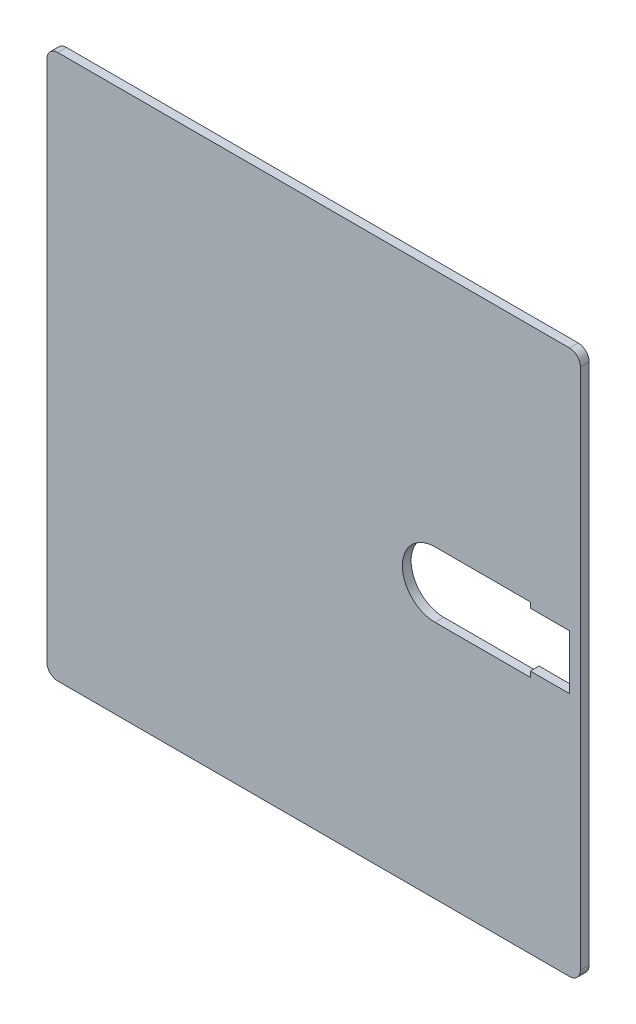
ISO-10303-21;
HEADER;
FILE_DESCRIPTION(('STEP AP214'),'2;1');
FILE_NAME('part.step','',(''),(''),'','','');
FILE_SCHEMA(('AUTOMOTIVE_DESIGN { 1 0 10303 214 1 1 1 1 }'));
ENDSEC;
DATA;
#1=APPLICATION_CONTEXT('core data for automotive mechanical design processes');
#2=APPLICATION_PROTOCOL_DEFINITION('international standard','automotive_design',2000,#1);
#3=PRODUCT_CONTEXT('',#1,'mechanical');
#4=PRODUCT('Part','Part','',(#3));
#5=PRODUCT_RELATED_PRODUCT_CATEGORY('part','',(#4));
#6=PRODUCT_DEFINITION_FORMATION('','',#4);
#7=PRODUCT_DEFINITION_CONTEXT('part definition',#1,'design');
#8=PRODUCT_DEFINITION('design','',#6,#7);
#9=PRODUCT_DEFINITION_SHAPE('','',#8);
#10=(LENGTH_UNIT() NAMED_UNIT(*) SI_UNIT(.MILLI.,.METRE.));
#11=(NAMED_UNIT(*) PLANE_ANGLE_UNIT() SI_UNIT($,.RADIAN.));
#12=(NAMED_UNIT(*) SI_UNIT($,.STERADIAN.) SOLID_ANGLE_UNIT());
#13=UNCERTAINTY_MEASURE_WITH_UNIT(LENGTH_MEASURE(1.E-05),#10,'distance_accuracy_value','');
#14=(GEOMETRIC_REPRESENTATION_CONTEXT(3) GLOBAL_UNCERTAINTY_ASSIGNED_CONTEXT((#13)) GLOBAL_UNIT_ASSIGNED_CONTEXT((#10,
#11,#12)) REPRESENTATION_CONTEXT('',''));
#15=CARTESIAN_POINT('',(0.,0.,0.));
#16=DIRECTION('',(0.,0.,1.));
#17=DIRECTION('',(1.,0.,0.));
#18=AXIS2_PLACEMENT_3D('',#15,#16,#17);
#19=CARTESIAN_POINT('',(0.,0.,1.6));
#20=DIRECTION('',(0.,1.,0.));
#21=DIRECTION('',(0.,0.,1.));
#22=AXIS2_PLACEMENT_3D('',#19,#20,#21);
#23=PLANE('',#22);
#24=DIRECTION('',(1.,0.,0.));
#25=VECTOR('',#24,1.);
#26=CARTESIAN_POINT('',(0.,0.,0.));
#27=LINE('',#26,#25);
#28=CARTESIAN_POINT('',(2.,0.,0.));
#29=VERTEX_POINT('',#28);
#30=CARTESIAN_POINT('',(96.,0.,0.));
#31=VERTEX_POINT('',#30);
#32=EDGE_CURVE('E218',#29,#31,#27,.T.);
#33=ORIENTED_EDGE('',*,*,#32,.T.);
#34=DIRECTION('',(0.,0.,-1.));
#35=VECTOR('',#34,1.);
#36=CARTESIAN_POINT('',(96.,0.,1.6));
#37=LINE('',#36,#35);
#38=CARTESIAN_POINT('',(96.,0.,1.6));
#39=VERTEX_POINT('',#38);
#40=EDGE_CURVE('E258',#31,#39,#37,.F.);
#41=ORIENTED_EDGE('',*,*,#40,.T.);
#42=DIRECTION('',(1.,0.,0.));
#43=VECTOR('',#42,1.);
#44=CARTESIAN_POINT('',(0.,0.,1.6));
#45=LINE('',#44,#43);
#46=CARTESIAN_POINT('',(2.,0.,1.6));
#47=VERTEX_POINT('',#46);
#48=EDGE_CURVE('E187',#47,#39,#45,.T.);
#49=ORIENTED_EDGE('',*,*,#48,.F.);
#50=DIRECTION('',(0.,0.,-1.));
#51=VECTOR('',#50,1.);
#52=CARTESIAN_POINT('',(2.,0.,0.));
#53=LINE('',#52,#51);
#54=EDGE_CURVE('E255',#47,#29,#53,.T.);
#55=ORIENTED_EDGE('',*,*,#54,.T.);
#56=EDGE_LOOP('',(#33,#41,#49,#55));
#57=FACE_BOUND('',#56,.T.);
#58=ADVANCED_FACE('F33',(#57),#23,.F.);
#59=CARTESIAN_POINT('',(98.,0.,1.6));
#60=DIRECTION('',(-1.,0.,0.));
#61=DIRECTION('',(0.,0.,1.));
#62=AXIS2_PLACEMENT_3D('',#59,#60,#61);
#63=PLANE('',#62);
#64=DIRECTION('',(0.,1.,0.));
#65=VECTOR('',#64,1.);
#66=CARTESIAN_POINT('',(98.,0.,1.6));
#67=LINE('',#66,#65);
#68=CARTESIAN_POINT('',(98.,2.,1.6));
#69=VERTEX_POINT('',#68);
#70=CARTESIAN_POINT('',(98.,98.,1.6));
#71=VERTEX_POINT('',#70);
#72=EDGE_CURVE('E190',#69,#71,#67,.T.);
#73=ORIENTED_EDGE('',*,*,#72,.F.);
#74=DIRECTION('',(0.,0.,-1.));
#75=VECTOR('',#74,1.);
#76=CARTESIAN_POINT('',(98.,2.,1.6));
#77=LINE('',#76,#75);
#78=CARTESIAN_POINT('',(98.,2.,0.));
#79=VERTEX_POINT('',#78);
#80=EDGE_CURVE('E244',#69,#79,#77,.T.);
#81=ORIENTED_EDGE('',*,*,#80,.T.);
#82=DIRECTION('',(0.,1.,0.));
#83=VECTOR('',#82,1.);
#84=CARTESIAN_POINT('',(98.,0.,0.));
#85=LINE('',#84,#83);
#86=CARTESIAN_POINT('',(98.,98.,0.));
#87=VERTEX_POINT('',#86);
#88=EDGE_CURVE('E221',#79,#87,#85,.T.);
#89=ORIENTED_EDGE('',*,*,#88,.T.);
#90=DIRECTION('',(0.,0.,-1.));
#91=VECTOR('',#90,1.);
#92=CARTESIAN_POINT('',(98.,98.,1.6));
#93=LINE('',#92,#91);
#94=EDGE_CURVE('E157',#87,#71,#93,.F.);
#95=ORIENTED_EDGE('',*,*,#94,.T.);
#96=EDGE_LOOP('',(#73,#81,#89,#95));
#97=FACE_BOUND('',#96,.T.);
#98=ADVANCED_FACE('F299',(#97),#63,.F.);
#99=CARTESIAN_POINT('',(0.,100.,1.6));
#100=DIRECTION('',(0.,1.,0.));
#101=DIRECTION('',(0.,0.,1.));
#102=AXIS2_PLACEMENT_3D('',#99,#100,#101);
#103=PLANE('',#102);
#104=DIRECTION('',(1.,0.,0.));
#105=VECTOR('',#104,1.);
#106=CARTESIAN_POINT('',(0.,100.,0.));
#107=LINE('',#106,#105);
#108=CARTESIAN_POINT('',(2.,100.,0.));
#109=VERTEX_POINT('',#108);
#110=CARTESIAN_POINT('',(96.,100.,0.));
#111=VERTEX_POINT('',#110);
#112=EDGE_CURVE('E224',#109,#111,#107,.T.);
#113=ORIENTED_EDGE('',*,*,#112,.F.);
#114=DIRECTION('',(0.,0.,-1.));
#115=VECTOR('',#114,1.);
#116=CARTESIAN_POINT('',(2.,100.,1.6));
#117=LINE('',#116,#115);
#118=CARTESIAN_POINT('',(2.,100.,1.6));
#119=VERTEX_POINT('',#118);
#120=EDGE_CURVE('E11',#109,#119,#117,.F.);
#121=ORIENTED_EDGE('',*,*,#120,.T.);
#122=DIRECTION('',(1.,0.,0.));
#123=VECTOR('',#122,1.);
#124=CARTESIAN_POINT('',(0.,100.,1.6));
#125=LINE('',#124,#123);
#126=CARTESIAN_POINT('',(96.,100.,1.6));
#127=VERTEX_POINT('',#126);
#128=EDGE_CURVE('E193',#119,#127,#125,.T.);
#129=ORIENTED_EDGE('',*,*,#128,.T.);
#130=DIRECTION('',(0.,0.,-1.));
#131=VECTOR('',#130,1.);
#132=CARTESIAN_POINT('',(96.,100.,0.));
#133=LINE('',#132,#131);
#134=EDGE_CURVE('E41',#127,#111,#133,.T.);
#135=ORIENTED_EDGE('',*,*,#134,.T.);
#136=EDGE_LOOP('',(#113,#121,#129,#135));
#137=FACE_BOUND('',#136,.T.);
#138=ADVANCED_FACE('F274',(#137),#103,.T.);
#139=CARTESIAN_POINT('',(71.3,50.,1.6));
#140=DIRECTION('',(0.,0.,-1.));
#141=DIRECTION('',(-1.,0.,0.));
#142=AXIS2_PLACEMENT_3D('',#139,#140,#141);
#143=CYLINDRICAL_SURFACE('',#142,6.);
#144=CARTESIAN_POINT('',(71.3,50.,0.));
#145=DIRECTION('',(0.,0.,1.));
#146=DIRECTION('',(1.,0.,0.));
#147=AXIS2_PLACEMENT_3D('',#144,#145,#146);
#148=CIRCLE('',#147,6.);
#149=CARTESIAN_POINT('',(71.3,56.,0.));
#150=VERTEX_POINT('',#149);
#151=CARTESIAN_POINT('',(71.3,44.,0.));
#152=VERTEX_POINT('',#151);
#153=EDGE_CURVE('E152',#150,#152,#148,.T.);
#154=ORIENTED_EDGE('',*,*,#153,.F.);
#155=DIRECTION('',(0.,0.,-1.));
#156=VECTOR('',#155,1.);
#157=CARTESIAN_POINT('',(71.3,56.,1.6));
#158=LINE('',#157,#156);
#159=CARTESIAN_POINT('',(71.3,56.,1.6));
#160=VERTEX_POINT('',#159);
#161=EDGE_CURVE('E147',#160,#150,#158,.T.);
#162=ORIENTED_EDGE('',*,*,#161,.F.);
#163=CARTESIAN_POINT('',(71.3,50.,1.6));
#164=DIRECTION('',(0.,0.,1.));
#165=DIRECTION('',(1.,0.,0.));
#166=AXIS2_PLACEMENT_3D('',#163,#164,#165);
#167=CIRCLE('',#166,6.);
#168=CARTESIAN_POINT('',(71.3,44.,1.6));
#169=VERTEX_POINT('',#168);
#170=EDGE_CURVE('E150',#160,#169,#167,.T.);
#171=ORIENTED_EDGE('',*,*,#170,.T.);
#172=DIRECTION('',(0.,0.,-1.));
#173=VECTOR('',#172,1.);
#174=CARTESIAN_POINT('',(71.3,44.,1.6));
#175=LINE('',#174,#173);
#176=EDGE_CURVE('E198',#169,#152,#175,.T.);
#177=ORIENTED_EDGE('',*,*,#176,.T.);
#178=EDGE_LOOP('',(#154,#162,#171,#177));
#179=FACE_BOUND('',#178,.T.);
#180=ADVANCED_FACE('F149',(#179),#143,.F.);
#181=CARTESIAN_POINT('',(0.,56.,1.6));
#182=DIRECTION('',(0.,-1.,0.));
#183=DIRECTION('',(0.,0.,-1.));
#184=AXIS2_PLACEMENT_3D('',#181,#182,#183);
#185=PLANE('',#184);
#186=DIRECTION('',(-1.,0.,0.));
#187=VECTOR('',#186,1.);
#188=CARTESIAN_POINT('',(0.,56.,0.));
#189=LINE('',#188,#187);
#190=CARTESIAN_POINT('',(88.8,56.,0.));
#191=VERTEX_POINT('',#190);
#192=EDGE_CURVE('E200',#191,#150,#189,.T.);
#193=ORIENTED_EDGE('',*,*,#192,.F.);
#194=DIRECTION('',(0.,0.,-1.));
#195=VECTOR('',#194,1.);
#196=CARTESIAN_POINT('',(88.8,56.,1.6));
#197=LINE('',#196,#195);
#198=CARTESIAN_POINT('',(88.8,56.,1.6));
#199=VERTEX_POINT('',#198);
#200=EDGE_CURVE('E158',#199,#191,#197,.T.);
#201=ORIENTED_EDGE('',*,*,#200,.F.);
#202=DIRECTION('',(-1.,0.,0.));
#203=VECTOR('',#202,1.);
#204=CARTESIAN_POINT('',(0.,56.,1.6));
#205=LINE('',#204,#203);
#206=EDGE_CURVE('E164',#199,#160,#205,.T.);
#207=ORIENTED_EDGE('',*,*,#206,.T.);
#208=ORIENTED_EDGE('',*,*,#161,.T.);
#209=EDGE_LOOP('',(#193,#201,#207,#208));
#210=FACE_BOUND('',#209,.T.);
#211=ADVANCED_FACE('F171',(#210),#185,.T.);
#212=CARTESIAN_POINT('',(88.8,0.,1.6));
#213=DIRECTION('',(-1.,0.,0.));
#214=DIRECTION('',(0.,0.,1.));
#215=AXIS2_PLACEMENT_3D('',#212,#213,#214);
#216=PLANE('',#215);
#217=DIRECTION('',(0.,1.,0.));
#218=VECTOR('',#217,1.);
#219=CARTESIAN_POINT('',(88.8,0.,0.));
#220=LINE('',#219,#218);
#221=CARTESIAN_POINT('',(88.8,55.,0.));
#222=VERTEX_POINT('',#221);
#223=EDGE_CURVE('E202',#222,#191,#220,.T.);
#224=ORIENTED_EDGE('',*,*,#223,.F.);
#225=DIRECTION('',(0.,0.,-1.));
#226=VECTOR('',#225,1.);
#227=CARTESIAN_POINT('',(88.8,55.,1.6));
#228=LINE('',#227,#226);
#229=CARTESIAN_POINT('',(88.8,55.,1.6));
#230=VERTEX_POINT('',#229);
#231=EDGE_CURVE('E240',#230,#222,#228,.T.);
#232=ORIENTED_EDGE('',*,*,#231,.F.);
#233=DIRECTION('',(0.,1.,0.));
#234=VECTOR('',#233,1.);
#235=CARTESIAN_POINT('',(88.8,0.,1.6));
#236=LINE('',#235,#234);
#237=EDGE_CURVE('E172',#230,#199,#236,.T.);
#238=ORIENTED_EDGE('',*,*,#237,.T.);
#239=ORIENTED_EDGE('',*,*,#200,.T.);
#240=EDGE_LOOP('',(#224,#232,#238,#239));
#241=FACE_BOUND('',#240,.T.);
#242=ADVANCED_FACE('F332',(#241),#216,.T.);
#243=CARTESIAN_POINT('',(0.,55.,1.6));
#244=DIRECTION('',(0.,-1.,0.));
#245=DIRECTION('',(0.,0.,-1.));
#246=AXIS2_PLACEMENT_3D('',#243,#244,#245);
#247=PLANE('',#246);
#248=DIRECTION('',(-1.,0.,0.));
#249=VECTOR('',#248,1.);
#250=CARTESIAN_POINT('',(0.,55.,0.));
#251=LINE('',#250,#249);
#252=CARTESIAN_POINT('',(96.,55.,0.));
#253=VERTEX_POINT('',#252);
#254=EDGE_CURVE('E205',#253,#222,#251,.T.);
#255=ORIENTED_EDGE('',*,*,#254,.F.);
#256=DIRECTION('',(0.,0.,-1.));
#257=VECTOR('',#256,1.);
#258=CARTESIAN_POINT('',(96.,55.,1.6));
#259=LINE('',#258,#257);
#260=CARTESIAN_POINT('',(96.,55.,1.6));
#261=VERTEX_POINT('',#260);
#262=EDGE_CURVE('E238',#261,#253,#259,.T.);
#263=ORIENTED_EDGE('',*,*,#262,.F.);
#264=DIRECTION('',(-1.,0.,0.));
#265=VECTOR('',#264,1.);
#266=CARTESIAN_POINT('',(0.,55.,1.6));
#267=LINE('',#266,#265);
#268=EDGE_CURVE('E174',#261,#230,#267,.T.);
#269=ORIENTED_EDGE('',*,*,#268,.T.);
#270=ORIENTED_EDGE('',*,*,#231,.T.);
#271=EDGE_LOOP('',(#255,#263,#269,#270));
#272=FACE_BOUND('',#271,.T.);
#273=ADVANCED_FACE('F328',(#272),#247,.T.);
#274=CARTESIAN_POINT('',(96.,0.,1.6));
#275=DIRECTION('',(-1.,0.,0.));
#276=DIRECTION('',(0.,0.,1.));
#277=AXIS2_PLACEMENT_3D('',#274,#275,#276);
#278=PLANE('',#277);
#279=DIRECTION('',(0.,1.,0.));
#280=VECTOR('',#279,1.);
#281=CARTESIAN_POINT('',(96.,0.,0.));
#282=LINE('',#281,#280);
#283=CARTESIAN_POINT('',(96.,45.,0.));
#284=VERTEX_POINT('',#283);
#285=EDGE_CURVE('E208',#284,#253,#282,.T.);
#286=ORIENTED_EDGE('',*,*,#285,.F.);
#287=DIRECTION('',(0.,0.,-1.));
#288=VECTOR('',#287,1.);
#289=CARTESIAN_POINT('',(96.,45.,1.6));
#290=LINE('',#289,#288);
#291=CARTESIAN_POINT('',(96.,45.,1.6));
#292=VERTEX_POINT('',#291);
#293=EDGE_CURVE('E236',#292,#284,#290,.T.);
#294=ORIENTED_EDGE('',*,*,#293,.F.);
#295=DIRECTION('',(0.,1.,0.));
#296=VECTOR('',#295,1.);
#297=CARTESIAN_POINT('',(96.,0.,1.6));
#298=LINE('',#297,#296);
#299=EDGE_CURVE('E179',#292,#261,#298,.T.);
#300=ORIENTED_EDGE('',*,*,#299,.T.);
#301=ORIENTED_EDGE('',*,*,#262,.T.);
#302=EDGE_LOOP('',(#286,#294,#300,#301));
#303=FACE_BOUND('',#302,.T.);
#304=ADVANCED_FACE('F324',(#303),#278,.T.);
#305=CARTESIAN_POINT('',(0.,45.,1.6));
#306=DIRECTION('',(0.,-1.,0.));
#307=DIRECTION('',(0.,0.,-1.));
#308=AXIS2_PLACEMENT_3D('',#305,#306,#307);
#309=PLANE('',#308);
#310=DIRECTION('',(-1.,0.,0.));
#311=VECTOR('',#310,1.);
#312=CARTESIAN_POINT('',(0.,45.,0.));
#313=LINE('',#312,#311);
#314=CARTESIAN_POINT('',(88.8,45.,0.));
#315=VERTEX_POINT('',#314);
#316=EDGE_CURVE('E211',#284,#315,#313,.T.);
#317=ORIENTED_EDGE('',*,*,#316,.T.);
#318=DIRECTION('',(0.,0.,-1.));
#319=VECTOR('',#318,1.);
#320=CARTESIAN_POINT('',(88.8,45.,1.6));
#321=LINE('',#320,#319);
#322=CARTESIAN_POINT('',(88.8,45.,1.6));
#323=VERTEX_POINT('',#322);
#324=EDGE_CURVE('E233',#323,#315,#321,.T.);
#325=ORIENTED_EDGE('',*,*,#324,.F.);
#326=DIRECTION('',(-1.,0.,0.));
#327=VECTOR('',#326,1.);
#328=CARTESIAN_POINT('',(0.,45.,1.6));
#329=LINE('',#328,#327);
#330=EDGE_CURVE('E182',#292,#323,#329,.T.);
#331=ORIENTED_EDGE('',*,*,#330,.F.);
#332=ORIENTED_EDGE('',*,*,#293,.T.);
#333=EDGE_LOOP('',(#317,#325,#331,#332));
#334=FACE_BOUND('',#333,.T.);
#335=ADVANCED_FACE('F320',(#334),#309,.F.);
#336=CARTESIAN_POINT('',(88.8,0.,1.6));
#337=DIRECTION('',(1.,0.,0.));
#338=DIRECTION('',(0.,0.,-1.));
#339=AXIS2_PLACEMENT_3D('',#336,#337,#338);
#340=PLANE('',#339);
#341=DIRECTION('',(0.,-1.,0.));
#342=VECTOR('',#341,1.);
#343=CARTESIAN_POINT('',(88.8,0.,0.));
#344=LINE('',#343,#342);
#345=CARTESIAN_POINT('',(88.8,44.,0.));
#346=VERTEX_POINT('',#345);
#347=EDGE_CURVE('E213',#315,#346,#344,.T.);
#348=ORIENTED_EDGE('',*,*,#347,.T.);
#349=DIRECTION('',(0.,0.,-1.));
#350=VECTOR('',#349,1.);
#351=CARTESIAN_POINT('',(88.8,44.,1.6));
#352=LINE('',#351,#350);
#353=CARTESIAN_POINT('',(88.8,44.,1.6));
#354=VERTEX_POINT('',#353);
#355=EDGE_CURVE('E230',#354,#346,#352,.T.);
#356=ORIENTED_EDGE('',*,*,#355,.F.);
#357=DIRECTION('',(0.,-1.,0.));
#358=VECTOR('',#357,1.);
#359=CARTESIAN_POINT('',(88.8,0.,1.6));
#360=LINE('',#359,#358);
#361=EDGE_CURVE('E184',#323,#354,#360,.T.);
#362=ORIENTED_EDGE('',*,*,#361,.F.);
#363=ORIENTED_EDGE('',*,*,#324,.T.);
#364=EDGE_LOOP('',(#348,#356,#362,#363));
#365=FACE_BOUND('',#364,.T.);
#366=ADVANCED_FACE('F316',(#365),#340,.F.);
#367=CARTESIAN_POINT('',(0.,44.,1.6));
#368=DIRECTION('',(0.,-1.,0.));
#369=DIRECTION('',(1.,0.,0.));
#370=AXIS2_PLACEMENT_3D('',#367,#368,#369);
#371=PLANE('',#370);
#372=DIRECTION('',(-1.,0.,0.));
#373=VECTOR('',#372,1.);
#374=CARTESIAN_POINT('',(0.,44.,0.));
#375=LINE('',#374,#373);
#376=EDGE_CURVE('E215',#346,#152,#375,.T.);
#377=ORIENTED_EDGE('',*,*,#376,.T.);
#378=ORIENTED_EDGE('',*,*,#176,.F.);
#379=DIRECTION('',(-1.,0.,0.));
#380=VECTOR('',#379,1.);
#381=CARTESIAN_POINT('',(0.,44.,1.6));
#382=LINE('',#381,#380);
#383=EDGE_CURVE('E167',#354,#169,#382,.T.);
#384=ORIENTED_EDGE('',*,*,#383,.F.);
#385=ORIENTED_EDGE('',*,*,#355,.T.);
#386=EDGE_LOOP('',(#377,#378,#384,#385));
#387=FACE_BOUND('',#386,.T.);
#388=ADVANCED_FACE('F313',(#387),#371,.F.);
#389=CARTESIAN_POINT('',(0.,0.,1.6));
#390=DIRECTION('',(-1.,0.,0.));
#391=DIRECTION('',(0.,0.,1.));
#392=AXIS2_PLACEMENT_3D('',#389,#390,#391);
#393=PLANE('',#392);
#394=DIRECTION('',(0.,1.,0.));
#395=VECTOR('',#394,1.);
#396=CARTESIAN_POINT('',(0.,0.,0.));
#397=LINE('',#396,#395);
#398=CARTESIAN_POINT('',(0.,2.,0.));
#399=VERTEX_POINT('',#398);
#400=CARTESIAN_POINT('',(0.,98.,0.));
#401=VERTEX_POINT('',#400);
#402=EDGE_CURVE('E169',#399,#401,#397,.T.);
#403=ORIENTED_EDGE('',*,*,#402,.F.);
#404=DIRECTION('',(0.,0.,-1.));
#405=VECTOR('',#404,1.);
#406=CARTESIAN_POINT('',(0.,2.,1.6));
#407=LINE('',#406,#405);
#408=CARTESIAN_POINT('',(0.,2.,1.6));
#409=VERTEX_POINT('',#408);
#410=EDGE_CURVE('E55',#399,#409,#407,.F.);
#411=ORIENTED_EDGE('',*,*,#410,.T.);
#412=DIRECTION('',(0.,1.,0.));
#413=VECTOR('',#412,1.);
#414=CARTESIAN_POINT('',(0.,0.,1.6));
#415=LINE('',#414,#413);
#416=CARTESIAN_POINT('',(0.,98.,1.6));
#417=VERTEX_POINT('',#416);
#418=EDGE_CURVE('E196',#409,#417,#415,.T.);
#419=ORIENTED_EDGE('',*,*,#418,.T.);
#420=DIRECTION('',(0.,0.,-1.));
#421=VECTOR('',#420,1.);
#422=CARTESIAN_POINT('',(0.,98.,1.6));
#423=LINE('',#422,#421);
#424=EDGE_CURVE('E267',#417,#401,#423,.T.);
#425=ORIENTED_EDGE('',*,*,#424,.T.);
#426=EDGE_LOOP('',(#403,#411,#419,#425));
#427=FACE_BOUND('',#426,.T.);
#428=ADVANCED_FACE('F284',(#427),#393,.T.);
#429=CARTESIAN_POINT('',(0.,0.,1.6));
#430=DIRECTION('',(0.,0.,1.));
#431=DIRECTION('',(1.,0.,0.));
#432=AXIS2_PLACEMENT_3D('',#429,#430,#431);
#433=PLANE('',#432);
#434=ORIENTED_EDGE('',*,*,#170,.F.);
#435=ORIENTED_EDGE('',*,*,#206,.F.);
#436=ORIENTED_EDGE('',*,*,#237,.F.);
#437=ORIENTED_EDGE('',*,*,#268,.F.);
#438=ORIENTED_EDGE('',*,*,#299,.F.);
#439=ORIENTED_EDGE('',*,*,#330,.T.);
#440=ORIENTED_EDGE('',*,*,#361,.T.);
#441=ORIENTED_EDGE('',*,*,#383,.T.);
#442=EDGE_LOOP('',(#434,#435,#436,#437,#438,#439,#440,#441));
#443=FACE_BOUND('',#442,.T.);
#444=ORIENTED_EDGE('',*,*,#48,.T.);
#445=CARTESIAN_POINT('',(96.,2.,1.6));
#446=DIRECTION('',(0.,0.,1.));
#447=DIRECTION('',(1.,0.,0.));
#448=AXIS2_PLACEMENT_3D('',#445,#446,#447);
#449=CIRCLE('',#448,2.);
#450=EDGE_CURVE('E265',#39,#69,#449,.T.);
#451=ORIENTED_EDGE('',*,*,#450,.T.);
#452=ORIENTED_EDGE('',*,*,#72,.T.);
#453=CARTESIAN_POINT('',(96.,98.,1.6));
#454=DIRECTION('',(0.,0.,1.));
#455=DIRECTION('',(1.,0.,0.));
#456=AXIS2_PLACEMENT_3D('',#453,#454,#455);
#457=CIRCLE('',#456,2.);
#458=EDGE_CURVE('E260',#71,#127,#457,.T.);
#459=ORIENTED_EDGE('',*,*,#458,.T.);
#460=ORIENTED_EDGE('',*,*,#128,.F.);
#461=CARTESIAN_POINT('',(2.,98.,1.6));
#462=DIRECTION('',(0.,0.,1.));
#463=DIRECTION('',(1.,0.,0.));
#464=AXIS2_PLACEMENT_3D('',#461,#462,#463);
#465=CIRCLE('',#464,2.);
#466=EDGE_CURVE('E48',#119,#417,#465,.T.);
#467=ORIENTED_EDGE('',*,*,#466,.T.);
#468=ORIENTED_EDGE('',*,*,#418,.F.);
#469=CARTESIAN_POINT('',(2.,2.,1.6));
#470=DIRECTION('',(0.,0.,1.));
#471=DIRECTION('',(1.,0.,0.));
#472=AXIS2_PLACEMENT_3D('',#469,#470,#471);
#473=CIRCLE('',#472,2.);
#474=EDGE_CURVE('E263',#409,#47,#473,.T.);
#475=ORIENTED_EDGE('',*,*,#474,.T.);
#476=EDGE_LOOP('',(#444,#451,#452,#459,#460,#467,#468,#475));
#477=FACE_BOUND('',#476,.T.);
#478=ADVANCED_FACE('F162',(#443,#477),#433,.T.);
#479=CARTESIAN_POINT('',(0.,0.,0.));
#480=DIRECTION('',(0.,0.,1.));
#481=DIRECTION('',(1.,0.,0.));
#482=AXIS2_PLACEMENT_3D('',#479,#480,#481);
#483=PLANE('',#482);
#484=ORIENTED_EDGE('',*,*,#153,.T.);
#485=ORIENTED_EDGE('',*,*,#376,.F.);
#486=ORIENTED_EDGE('',*,*,#347,.F.);
#487=ORIENTED_EDGE('',*,*,#316,.F.);
#488=ORIENTED_EDGE('',*,*,#285,.T.);
#489=ORIENTED_EDGE('',*,*,#254,.T.);
#490=ORIENTED_EDGE('',*,*,#223,.T.);
#491=ORIENTED_EDGE('',*,*,#192,.T.);
#492=EDGE_LOOP('',(#484,#485,#486,#487,#488,#489,#490,#491));
#493=FACE_BOUND('',#492,.T.);
#494=ORIENTED_EDGE('',*,*,#88,.F.);
#495=CARTESIAN_POINT('',(96.,2.,0.));
#496=DIRECTION('',(0.,0.,1.));
#497=DIRECTION('',(1.,0.,0.));
#498=AXIS2_PLACEMENT_3D('',#495,#496,#497);
#499=CIRCLE('',#498,2.);
#500=EDGE_CURVE('E253',#79,#31,#499,.F.);
#501=ORIENTED_EDGE('',*,*,#500,.T.);
#502=ORIENTED_EDGE('',*,*,#32,.F.);
#503=CARTESIAN_POINT('',(2.,2.,0.));
#504=DIRECTION('',(0.,0.,1.));
#505=DIRECTION('',(1.,0.,0.));
#506=AXIS2_PLACEMENT_3D('',#503,#504,#505);
#507=CIRCLE('',#506,2.);
#508=EDGE_CURVE('E251',#29,#399,#507,.F.);
#509=ORIENTED_EDGE('',*,*,#508,.T.);
#510=ORIENTED_EDGE('',*,*,#402,.T.);
#511=CARTESIAN_POINT('',(2.,98.,0.));
#512=DIRECTION('',(0.,0.,1.));
#513=DIRECTION('',(1.,0.,0.));
#514=AXIS2_PLACEMENT_3D('',#511,#512,#513);
#515=CIRCLE('',#514,2.);
#516=EDGE_CURVE('E249',#401,#109,#515,.F.);
#517=ORIENTED_EDGE('',*,*,#516,.T.);
#518=ORIENTED_EDGE('',*,*,#112,.T.);
#519=CARTESIAN_POINT('',(96.,98.,0.));
#520=DIRECTION('',(0.,0.,1.));
#521=DIRECTION('',(1.,0.,0.));
#522=AXIS2_PLACEMENT_3D('',#519,#520,#521);
#523=CIRCLE('',#522,2.);
#524=EDGE_CURVE('E247',#111,#87,#523,.F.);
#525=ORIENTED_EDGE('',*,*,#524,.T.);
#526=EDGE_LOOP('',(#494,#501,#502,#509,#510,#517,#518,#525));
#527=FACE_BOUND('',#526,.T.);
#528=ADVANCED_FACE('F280',(#493,#527),#483,.F.);
#529=CARTESIAN_POINT('',(96.,2.,1.6));
#530=DIRECTION('',(0.,0.,-1.));
#531=DIRECTION('',(-1.,0.,0.));
#532=AXIS2_PLACEMENT_3D('',#529,#530,#531);
#533=CYLINDRICAL_SURFACE('',#532,2.);
#534=ORIENTED_EDGE('',*,*,#450,.F.);
#535=ORIENTED_EDGE('',*,*,#40,.F.);
#536=ORIENTED_EDGE('',*,*,#500,.F.);
#537=ORIENTED_EDGE('',*,*,#80,.F.);
#538=EDGE_LOOP('',(#534,#535,#536,#537));
#539=FACE_BOUND('',#538,.T.);
#540=ADVANCED_FACE('F296',(#539),#533,.T.);
#541=CARTESIAN_POINT('',(2.,2.,1.6));
#542=DIRECTION('',(0.,0.,1.));
#543=DIRECTION('',(1.,0.,0.));
#544=AXIS2_PLACEMENT_3D('',#541,#542,#543);
#545=CYLINDRICAL_SURFACE('',#544,2.);
#546=ORIENTED_EDGE('',*,*,#474,.F.);
#547=ORIENTED_EDGE('',*,*,#410,.F.);
#548=ORIENTED_EDGE('',*,*,#508,.F.);
#549=ORIENTED_EDGE('',*,*,#54,.F.);
#550=EDGE_LOOP('',(#546,#547,#548,#549));
#551=FACE_BOUND('',#550,.T.);
#552=ADVANCED_FACE('F289',(#551),#545,.T.);
#553=CARTESIAN_POINT('',(2.,98.,1.6));
#554=DIRECTION('',(0.,0.,-1.));
#555=DIRECTION('',(-1.,0.,0.));
#556=AXIS2_PLACEMENT_3D('',#553,#554,#555);
#557=CYLINDRICAL_SURFACE('',#556,2.);
#558=ORIENTED_EDGE('',*,*,#466,.F.);
#559=ORIENTED_EDGE('',*,*,#120,.F.);
#560=ORIENTED_EDGE('',*,*,#516,.F.);
#561=ORIENTED_EDGE('',*,*,#424,.F.);
#562=EDGE_LOOP('',(#558,#559,#560,#561));
#563=FACE_BOUND('',#562,.T.);
#564=ADVANCED_FACE('F283',(#563),#557,.T.);
#565=CARTESIAN_POINT('',(96.,98.,1.6));
#566=DIRECTION('',(0.,0.,1.));
#567=DIRECTION('',(1.,0.,0.));
#568=AXIS2_PLACEMENT_3D('',#565,#566,#567);
#569=CYLINDRICAL_SURFACE('',#568,2.);
#570=ORIENTED_EDGE('',*,*,#458,.F.);
#571=ORIENTED_EDGE('',*,*,#94,.F.);
#572=ORIENTED_EDGE('',*,*,#524,.F.);
#573=ORIENTED_EDGE('',*,*,#134,.F.);
#574=EDGE_LOOP('',(#570,#571,#572,#573));
#575=FACE_BOUND('',#574,.T.);
#576=ADVANCED_FACE('F35',(#575),#569,.T.);
#577=CLOSED_SHELL('',(#58,#98,#138,#180,#211,#242,#273,#304,#335,#366,#388,#428,#478,#528,#540,
#552,#564,#576));
#578=MANIFOLD_SOLID_BREP('B2',#577);
#579=ADVANCED_BREP_SHAPE_REPRESENTATION('',(#18,#578),#14);
#580=SHAPE_DEFINITION_REPRESENTATION(#9,#579);
ENDSEC;
END-ISO-10303-21;
